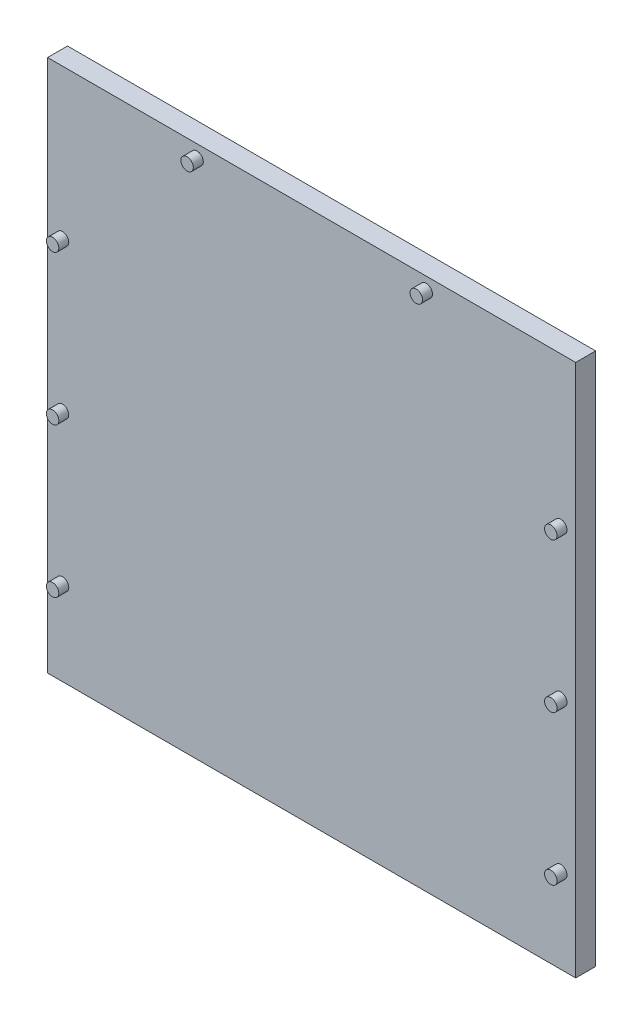
ISO-10303-21;
HEADER;
FILE_DESCRIPTION(('STEP AP214'),'2;1');
FILE_NAME('part.step','',(''),(''),'','','');
FILE_SCHEMA(('AUTOMOTIVE_DESIGN { 1 0 10303 214 1 1 1 1 }'));
ENDSEC;
DATA;
#1=APPLICATION_CONTEXT('core data for automotive mechanical design processes');
#2=APPLICATION_PROTOCOL_DEFINITION('international standard','automotive_design',2000,#1);
#3=PRODUCT_CONTEXT('',#1,'mechanical');
#4=PRODUCT('Part','Part','',(#3));
#5=PRODUCT_RELATED_PRODUCT_CATEGORY('part','',(#4));
#6=PRODUCT_DEFINITION_FORMATION('','',#4);
#7=PRODUCT_DEFINITION_CONTEXT('part definition',#1,'design');
#8=PRODUCT_DEFINITION('design','',#6,#7);
#9=PRODUCT_DEFINITION_SHAPE('','',#8);
#10=(LENGTH_UNIT() NAMED_UNIT(*) SI_UNIT(.MILLI.,.METRE.));
#11=(NAMED_UNIT(*) PLANE_ANGLE_UNIT() SI_UNIT($,.RADIAN.));
#12=(NAMED_UNIT(*) SI_UNIT($,.STERADIAN.) SOLID_ANGLE_UNIT());
#13=UNCERTAINTY_MEASURE_WITH_UNIT(LENGTH_MEASURE(1.E-05),#10,'distance_accuracy_value','');
#14=(GEOMETRIC_REPRESENTATION_CONTEXT(3) GLOBAL_UNCERTAINTY_ASSIGNED_CONTEXT((#13)) GLOBAL_UNIT_ASSIGNED_CONTEXT((#10,
#11,#12)) REPRESENTATION_CONTEXT('',''));
#15=CARTESIAN_POINT('',(0.,0.,0.));
#16=DIRECTION('',(0.,0.,1.));
#17=DIRECTION('',(1.,0.,0.));
#18=AXIS2_PLACEMENT_3D('',#15,#16,#17);
#19=CARTESIAN_POINT('',(-26.5,-26.75,2.));
#20=DIRECTION('',(1.,0.,0.));
#21=DIRECTION('',(0.,0.,-1.));
#22=AXIS2_PLACEMENT_3D('',#19,#20,#21);
#23=PLANE('',#22);
#24=DIRECTION('',(0.,-1.,0.));
#25=VECTOR('',#24,1.);
#26=CARTESIAN_POINT('',(-26.5,-26.75,0.));
#27=LINE('',#26,#25);
#28=CARTESIAN_POINT('',(-26.5,26.75,0.));
#29=VERTEX_POINT('',#28);
#30=CARTESIAN_POINT('',(-26.5,-26.75,0.));
#31=VERTEX_POINT('',#30);
#32=EDGE_CURVE('E96',#29,#31,#27,.T.);
#33=ORIENTED_EDGE('',*,*,#32,.T.);
#34=DIRECTION('',(0.,0.,-1.));
#35=VECTOR('',#34,1.);
#36=CARTESIAN_POINT('',(-26.5,-26.75,2.));
#37=LINE('',#36,#35);
#38=CARTESIAN_POINT('',(-26.5,-26.75,2.));
#39=VERTEX_POINT('',#38);
#40=EDGE_CURVE('E11',#39,#31,#37,.T.);
#41=ORIENTED_EDGE('',*,*,#40,.F.);
#42=DIRECTION('',(0.,-1.,0.));
#43=VECTOR('',#42,1.);
#44=CARTESIAN_POINT('',(-26.5,-26.75,2.));
#45=LINE('',#44,#43);
#46=CARTESIAN_POINT('',(-26.5,26.75,2.));
#47=VERTEX_POINT('',#46);
#48=EDGE_CURVE('E84',#47,#39,#45,.T.);
#49=ORIENTED_EDGE('',*,*,#48,.F.);
#50=DIRECTION('',(0.,0.,-1.));
#51=VECTOR('',#50,1.);
#52=CARTESIAN_POINT('',(-26.5,26.75,2.));
#53=LINE('',#52,#51);
#54=EDGE_CURVE('E92',#47,#29,#53,.T.);
#55=ORIENTED_EDGE('',*,*,#54,.T.);
#56=EDGE_LOOP('',(#33,#41,#49,#55));
#57=FACE_BOUND('',#56,.T.);
#58=ADVANCED_FACE('F33',(#57),#23,.F.);
#59=CARTESIAN_POINT('',(26.5,-26.75,2.));
#60=DIRECTION('',(0.,1.,0.));
#61=DIRECTION('',(-1.,0.,0.));
#62=AXIS2_PLACEMENT_3D('',#59,#60,#61);
#63=PLANE('',#62);
#64=DIRECTION('',(1.,0.,0.));
#65=VECTOR('',#64,1.);
#66=CARTESIAN_POINT('',(26.5,-26.75,0.));
#67=LINE('',#66,#65);
#68=CARTESIAN_POINT('',(26.5,-26.75,0.));
#69=VERTEX_POINT('',#68);
#70=EDGE_CURVE('E88',#31,#69,#67,.T.);
#71=ORIENTED_EDGE('',*,*,#70,.T.);
#72=DIRECTION('',(0.,0.,-1.));
#73=VECTOR('',#72,1.);
#74=CARTESIAN_POINT('',(26.5,-26.75,2.));
#75=LINE('',#74,#73);
#76=CARTESIAN_POINT('',(26.5,-26.75,2.));
#77=VERTEX_POINT('',#76);
#78=EDGE_CURVE('E41',#77,#69,#75,.T.);
#79=ORIENTED_EDGE('',*,*,#78,.F.);
#80=DIRECTION('',(1.,0.,0.));
#81=VECTOR('',#80,1.);
#82=CARTESIAN_POINT('',(26.5,-26.75,2.));
#83=LINE('',#82,#81);
#84=EDGE_CURVE('E79',#39,#77,#83,.T.);
#85=ORIENTED_EDGE('',*,*,#84,.F.);
#86=ORIENTED_EDGE('',*,*,#40,.T.);
#87=EDGE_LOOP('',(#71,#79,#85,#86));
#88=FACE_BOUND('',#87,.T.);
#89=ADVANCED_FACE('F87',(#88),#63,.F.);
#90=CARTESIAN_POINT('',(26.5,-26.75,2.));
#91=DIRECTION('',(-1.,0.,0.));
#92=DIRECTION('',(0.,0.,1.));
#93=AXIS2_PLACEMENT_3D('',#90,#91,#92);
#94=PLANE('',#93);
#95=DIRECTION('',(0.,1.,0.));
#96=VECTOR('',#95,1.);
#97=CARTESIAN_POINT('',(26.5,-26.75,0.));
#98=LINE('',#97,#96);
#99=CARTESIAN_POINT('',(26.5,26.75,0.));
#100=VERTEX_POINT('',#99);
#101=EDGE_CURVE('E66',#69,#100,#98,.T.);
#102=ORIENTED_EDGE('',*,*,#101,.T.);
#103=DIRECTION('',(0.,0.,-1.));
#104=VECTOR('',#103,1.);
#105=CARTESIAN_POINT('',(26.5,26.75,2.));
#106=LINE('',#105,#104);
#107=CARTESIAN_POINT('',(26.5,26.75,2.));
#108=VERTEX_POINT('',#107);
#109=EDGE_CURVE('E89',#108,#100,#106,.T.);
#110=ORIENTED_EDGE('',*,*,#109,.F.);
#111=DIRECTION('',(0.,1.,0.));
#112=VECTOR('',#111,1.);
#113=CARTESIAN_POINT('',(26.5,-26.75,2.));
#114=LINE('',#113,#112);
#115=EDGE_CURVE('E82',#77,#108,#114,.T.);
#116=ORIENTED_EDGE('',*,*,#115,.F.);
#117=ORIENTED_EDGE('',*,*,#78,.T.);
#118=EDGE_LOOP('',(#102,#110,#116,#117));
#119=FACE_BOUND('',#118,.T.);
#120=ADVANCED_FACE('F90',(#119),#94,.F.);
#121=CARTESIAN_POINT('',(26.5,26.75,2.));
#122=DIRECTION('',(0.,-1.,0.));
#123=DIRECTION('',(1.,0.,0.));
#124=AXIS2_PLACEMENT_3D('',#121,#122,#123);
#125=PLANE('',#124);
#126=DIRECTION('',(-1.,0.,0.));
#127=VECTOR('',#126,1.);
#128=CARTESIAN_POINT('',(26.5,26.75,0.));
#129=LINE('',#128,#127);
#130=EDGE_CURVE('E72',#100,#29,#129,.T.);
#131=ORIENTED_EDGE('',*,*,#130,.T.);
#132=ORIENTED_EDGE('',*,*,#54,.F.);
#133=DIRECTION('',(-1.,0.,0.));
#134=VECTOR('',#133,1.);
#135=CARTESIAN_POINT('',(26.5,26.75,2.));
#136=LINE('',#135,#134);
#137=EDGE_CURVE('E49',#108,#47,#136,.T.);
#138=ORIENTED_EDGE('',*,*,#137,.F.);
#139=ORIENTED_EDGE('',*,*,#109,.T.);
#140=EDGE_LOOP('',(#131,#132,#138,#139));
#141=FACE_BOUND('',#140,.T.);
#142=ADVANCED_FACE('F104',(#141),#125,.F.);
#143=CARTESIAN_POINT('',(0.,0.,2.));
#144=DIRECTION('',(0.,0.,1.));
#145=DIRECTION('',(1.,0.,0.));
#146=AXIS2_PLACEMENT_3D('',#143,#144,#145);
#147=PLANE('',#146);
#148=CARTESIAN_POINT('',(25.,-18.25,2.));
#149=DIRECTION('',(0.,0.,1.));
#150=DIRECTION('',(1.,0.,0.));
#151=AXIS2_PLACEMENT_3D('',#148,#149,#150);
#152=CIRCLE('',#151,0.625000000000002);
#153=CARTESIAN_POINT('',(25.625,-18.25,2.));
#154=VERTEX_POINT('',#153);
#155=EDGE_CURVE('E152',#154,#154,#152,.T.);
#156=ORIENTED_EDGE('',*,*,#155,.F.);
#157=EDGE_LOOP('',(#156));
#158=FACE_BOUND('',#157,.T.);
#159=CARTESIAN_POINT('',(25.,-3.25,2.));
#160=DIRECTION('',(0.,0.,1.));
#161=DIRECTION('',(1.,0.,0.));
#162=AXIS2_PLACEMENT_3D('',#159,#160,#161);
#163=CIRCLE('',#162,0.624999999999999);
#164=CARTESIAN_POINT('',(25.625,-3.25,2.));
#165=VERTEX_POINT('',#164);
#166=EDGE_CURVE('E146',#165,#165,#163,.T.);
#167=ORIENTED_EDGE('',*,*,#166,.F.);
#168=EDGE_LOOP('',(#167));
#169=FACE_BOUND('',#168,.T.);
#170=CARTESIAN_POINT('',(25.,11.75,2.));
#171=DIRECTION('',(0.,0.,1.));
#172=DIRECTION('',(1.,0.,0.));
#173=AXIS2_PLACEMENT_3D('',#170,#171,#172);
#174=CIRCLE('',#173,0.625000000000002);
#175=CARTESIAN_POINT('',(25.625,11.75,2.));
#176=VERTEX_POINT('',#175);
#177=EDGE_CURVE('E140',#176,#176,#174,.T.);
#178=ORIENTED_EDGE('',*,*,#177,.F.);
#179=EDGE_LOOP('',(#178));
#180=FACE_BOUND('',#179,.T.);
#181=CARTESIAN_POINT('',(-25.,-18.25,2.));
#182=DIRECTION('',(0.,0.,1.));
#183=DIRECTION('',(1.,0.,0.));
#184=AXIS2_PLACEMENT_3D('',#181,#182,#183);
#185=CIRCLE('',#184,0.624999999999999);
#186=CARTESIAN_POINT('',(-24.375,-18.25,2.));
#187=VERTEX_POINT('',#186);
#188=EDGE_CURVE('E134',#187,#187,#185,.T.);
#189=ORIENTED_EDGE('',*,*,#188,.F.);
#190=EDGE_LOOP('',(#189));
#191=FACE_BOUND('',#190,.T.);
#192=CARTESIAN_POINT('',(-25.,-3.25,2.));
#193=DIRECTION('',(0.,0.,1.));
#194=DIRECTION('',(1.,0.,0.));
#195=AXIS2_PLACEMENT_3D('',#192,#193,#194);
#196=CIRCLE('',#195,0.625000000000002);
#197=CARTESIAN_POINT('',(-24.375,-3.25,2.));
#198=VERTEX_POINT('',#197);
#199=EDGE_CURVE('E128',#198,#198,#196,.T.);
#200=ORIENTED_EDGE('',*,*,#199,.F.);
#201=EDGE_LOOP('',(#200));
#202=FACE_BOUND('',#201,.T.);
#203=CARTESIAN_POINT('',(-25.,11.75,2.));
#204=DIRECTION('',(0.,0.,1.));
#205=DIRECTION('',(1.,0.,0.));
#206=AXIS2_PLACEMENT_3D('',#203,#204,#205);
#207=CIRCLE('',#206,0.625000000000002);
#208=CARTESIAN_POINT('',(-24.375,11.75,2.));
#209=VERTEX_POINT('',#208);
#210=EDGE_CURVE('E122',#209,#209,#207,.T.);
#211=ORIENTED_EDGE('',*,*,#210,.F.);
#212=EDGE_LOOP('',(#211));
#213=FACE_BOUND('',#212,.T.);
#214=CARTESIAN_POINT('',(11.5,25.5,2.));
#215=DIRECTION('',(0.,0.,1.));
#216=DIRECTION('',(1.,0.,0.));
#217=AXIS2_PLACEMENT_3D('',#214,#215,#216);
#218=CIRCLE('',#217,0.625000000000001);
#219=CARTESIAN_POINT('',(12.125,25.5,2.));
#220=VERTEX_POINT('',#219);
#221=EDGE_CURVE('E116',#220,#220,#218,.T.);
#222=ORIENTED_EDGE('',*,*,#221,.F.);
#223=EDGE_LOOP('',(#222));
#224=FACE_BOUND('',#223,.T.);
#225=CARTESIAN_POINT('',(-11.5,25.5,2.));
#226=DIRECTION('',(0.,0.,1.));
#227=DIRECTION('',(1.,0.,0.));
#228=AXIS2_PLACEMENT_3D('',#225,#226,#227);
#229=CIRCLE('',#228,0.625000000000001);
#230=CARTESIAN_POINT('',(-10.875,25.5,2.));
#231=VERTEX_POINT('',#230);
#232=EDGE_CURVE('E110',#231,#231,#229,.T.);
#233=ORIENTED_EDGE('',*,*,#232,.F.);
#234=EDGE_LOOP('',(#233));
#235=FACE_BOUND('',#234,.T.);
#236=ORIENTED_EDGE('',*,*,#48,.T.);
#237=ORIENTED_EDGE('',*,*,#84,.T.);
#238=ORIENTED_EDGE('',*,*,#115,.T.);
#239=ORIENTED_EDGE('',*,*,#137,.T.);
#240=EDGE_LOOP('',(#236,#237,#238,#239));
#241=FACE_BOUND('',#240,.T.);
#242=ADVANCED_FACE('F80',(#158,#169,#180,#191,#202,#213,#224,#235,#241),#147,.T.);
#243=CARTESIAN_POINT('',(0.,0.,0.));
#244=DIRECTION('',(0.,0.,1.));
#245=DIRECTION('',(1.,0.,0.));
#246=AXIS2_PLACEMENT_3D('',#243,#244,#245);
#247=PLANE('',#246);
#248=ORIENTED_EDGE('',*,*,#32,.F.);
#249=ORIENTED_EDGE('',*,*,#130,.F.);
#250=ORIENTED_EDGE('',*,*,#101,.F.);
#251=ORIENTED_EDGE('',*,*,#70,.F.);
#252=EDGE_LOOP('',(#248,#249,#250,#251));
#253=FACE_BOUND('',#252,.T.);
#254=ADVANCED_FACE('F107',(#253),#247,.F.);
#255=CARTESIAN_POINT('',(-11.5,25.5,3.));
#256=DIRECTION('',(0.,0.,-1.));
#257=DIRECTION('',(-1.,0.,0.));
#258=AXIS2_PLACEMENT_3D('',#255,#256,#257);
#259=CYLINDRICAL_SURFACE('',#258,0.625000000000001);
#260=CARTESIAN_POINT('',(-11.5,25.5,3.));
#261=DIRECTION('',(0.,0.,1.));
#262=DIRECTION('',(1.,0.,0.));
#263=AXIS2_PLACEMENT_3D('',#260,#261,#262);
#264=CIRCLE('',#263,0.625000000000001);
#265=CARTESIAN_POINT('',(-10.875,25.5,3.));
#266=VERTEX_POINT('',#265);
#267=EDGE_CURVE('E99',#266,#266,#264,.T.);
#268=ORIENTED_EDGE('',*,*,#267,.F.);
#269=EDGE_LOOP('',(#268));
#270=FACE_BOUND('',#269,.T.);
#271=ORIENTED_EDGE('',*,*,#232,.T.);
#272=EDGE_LOOP('',(#271));
#273=FACE_BOUND('',#272,.T.);
#274=ADVANCED_FACE('F184',(#270,#273),#259,.T.);
#275=CARTESIAN_POINT('',(-11.5,25.5,3.));
#276=DIRECTION('',(0.,0.,1.));
#277=DIRECTION('',(1.,0.,0.));
#278=AXIS2_PLACEMENT_3D('',#275,#276,#277);
#279=PLANE('',#278);
#280=ORIENTED_EDGE('',*,*,#267,.T.);
#281=EDGE_LOOP('',(#280));
#282=FACE_BOUND('',#281,.T.);
#283=ADVANCED_FACE('F186',(#282),#279,.T.);
#284=CARTESIAN_POINT('',(11.5,25.5,3.));
#285=DIRECTION('',(0.,0.,-1.));
#286=DIRECTION('',(-1.,0.,0.));
#287=AXIS2_PLACEMENT_3D('',#284,#285,#286);
#288=CYLINDRICAL_SURFACE('',#287,0.625000000000001);
#289=CARTESIAN_POINT('',(11.5,25.5,3.));
#290=DIRECTION('',(0.,0.,1.));
#291=DIRECTION('',(1.,0.,0.));
#292=AXIS2_PLACEMENT_3D('',#289,#290,#291);
#293=CIRCLE('',#292,0.625000000000001);
#294=CARTESIAN_POINT('',(12.125,25.5,3.));
#295=VERTEX_POINT('',#294);
#296=EDGE_CURVE('E113',#295,#295,#293,.T.);
#297=ORIENTED_EDGE('',*,*,#296,.F.);
#298=EDGE_LOOP('',(#297));
#299=FACE_BOUND('',#298,.T.);
#300=ORIENTED_EDGE('',*,*,#221,.T.);
#301=EDGE_LOOP('',(#300));
#302=FACE_BOUND('',#301,.T.);
#303=ADVANCED_FACE('F193',(#299,#302),#288,.T.);
#304=CARTESIAN_POINT('',(11.5,25.5,3.));
#305=DIRECTION('',(0.,0.,1.));
#306=DIRECTION('',(1.,0.,0.));
#307=AXIS2_PLACEMENT_3D('',#304,#305,#306);
#308=PLANE('',#307);
#309=ORIENTED_EDGE('',*,*,#296,.T.);
#310=EDGE_LOOP('',(#309));
#311=FACE_BOUND('',#310,.T.);
#312=ADVANCED_FACE('F241',(#311),#308,.T.);
#313=CARTESIAN_POINT('',(-25.,11.75,3.));
#314=DIRECTION('',(0.,0.,-1.));
#315=DIRECTION('',(-1.,0.,0.));
#316=AXIS2_PLACEMENT_3D('',#313,#314,#315);
#317=CYLINDRICAL_SURFACE('',#316,0.625000000000002);
#318=CARTESIAN_POINT('',(-25.,11.75,3.));
#319=DIRECTION('',(0.,0.,1.));
#320=DIRECTION('',(1.,0.,0.));
#321=AXIS2_PLACEMENT_3D('',#318,#319,#320);
#322=CIRCLE('',#321,0.625000000000002);
#323=CARTESIAN_POINT('',(-24.375,11.75,3.));
#324=VERTEX_POINT('',#323);
#325=EDGE_CURVE('E119',#324,#324,#322,.T.);
#326=ORIENTED_EDGE('',*,*,#325,.F.);
#327=EDGE_LOOP('',(#326));
#328=FACE_BOUND('',#327,.T.);
#329=ORIENTED_EDGE('',*,*,#210,.T.);
#330=EDGE_LOOP('',(#329));
#331=FACE_BOUND('',#330,.T.);
#332=ADVANCED_FACE('F250',(#328,#331),#317,.T.);
#333=CARTESIAN_POINT('',(-25.,11.75,3.));
#334=DIRECTION('',(0.,0.,1.));
#335=DIRECTION('',(1.,0.,0.));
#336=AXIS2_PLACEMENT_3D('',#333,#334,#335);
#337=PLANE('',#336);
#338=ORIENTED_EDGE('',*,*,#325,.T.);
#339=EDGE_LOOP('',(#338));
#340=FACE_BOUND('',#339,.T.);
#341=ADVANCED_FACE('F259',(#340),#337,.T.);
#342=CARTESIAN_POINT('',(-25.,-3.25,3.));
#343=DIRECTION('',(0.,0.,-1.));
#344=DIRECTION('',(-1.,0.,0.));
#345=AXIS2_PLACEMENT_3D('',#342,#343,#344);
#346=CYLINDRICAL_SURFACE('',#345,0.625000000000002);
#347=CARTESIAN_POINT('',(-25.,-3.25,3.));
#348=DIRECTION('',(0.,0.,1.));
#349=DIRECTION('',(1.,0.,0.));
#350=AXIS2_PLACEMENT_3D('',#347,#348,#349);
#351=CIRCLE('',#350,0.625000000000002);
#352=CARTESIAN_POINT('',(-24.375,-3.25,3.));
#353=VERTEX_POINT('',#352);
#354=EDGE_CURVE('E125',#353,#353,#351,.T.);
#355=ORIENTED_EDGE('',*,*,#354,.F.);
#356=EDGE_LOOP('',(#355));
#357=FACE_BOUND('',#356,.T.);
#358=ORIENTED_EDGE('',*,*,#199,.T.);
#359=EDGE_LOOP('',(#358));
#360=FACE_BOUND('',#359,.T.);
#361=ADVANCED_FACE('F268',(#357,#360),#346,.T.);
#362=CARTESIAN_POINT('',(-25.,-3.25,3.));
#363=DIRECTION('',(0.,0.,1.));
#364=DIRECTION('',(1.,0.,0.));
#365=AXIS2_PLACEMENT_3D('',#362,#363,#364);
#366=PLANE('',#365);
#367=ORIENTED_EDGE('',*,*,#354,.T.);
#368=EDGE_LOOP('',(#367));
#369=FACE_BOUND('',#368,.T.);
#370=ADVANCED_FACE('F277',(#369),#366,.T.);
#371=CARTESIAN_POINT('',(-25.,-18.25,3.));
#372=DIRECTION('',(0.,0.,-1.));
#373=DIRECTION('',(-1.,0.,0.));
#374=AXIS2_PLACEMENT_3D('',#371,#372,#373);
#375=CYLINDRICAL_SURFACE('',#374,0.624999999999999);
#376=CARTESIAN_POINT('',(-25.,-18.25,3.));
#377=DIRECTION('',(0.,0.,1.));
#378=DIRECTION('',(1.,0.,0.));
#379=AXIS2_PLACEMENT_3D('',#376,#377,#378);
#380=CIRCLE('',#379,0.624999999999999);
#381=CARTESIAN_POINT('',(-24.375,-18.25,3.));
#382=VERTEX_POINT('',#381);
#383=EDGE_CURVE('E131',#382,#382,#380,.T.);
#384=ORIENTED_EDGE('',*,*,#383,.F.);
#385=EDGE_LOOP('',(#384));
#386=FACE_BOUND('',#385,.T.);
#387=ORIENTED_EDGE('',*,*,#188,.T.);
#388=EDGE_LOOP('',(#387));
#389=FACE_BOUND('',#388,.T.);
#390=ADVANCED_FACE('F286',(#386,#389),#375,.T.);
#391=CARTESIAN_POINT('',(-25.,-18.25,3.));
#392=DIRECTION('',(0.,0.,1.));
#393=DIRECTION('',(1.,0.,0.));
#394=AXIS2_PLACEMENT_3D('',#391,#392,#393);
#395=PLANE('',#394);
#396=ORIENTED_EDGE('',*,*,#383,.T.);
#397=EDGE_LOOP('',(#396));
#398=FACE_BOUND('',#397,.T.);
#399=ADVANCED_FACE('F295',(#398),#395,.T.);
#400=CARTESIAN_POINT('',(25.,11.75,3.));
#401=DIRECTION('',(0.,0.,-1.));
#402=DIRECTION('',(-1.,0.,0.));
#403=AXIS2_PLACEMENT_3D('',#400,#401,#402);
#404=CYLINDRICAL_SURFACE('',#403,0.625000000000002);
#405=CARTESIAN_POINT('',(25.,11.75,3.));
#406=DIRECTION('',(0.,0.,1.));
#407=DIRECTION('',(1.,0.,0.));
#408=AXIS2_PLACEMENT_3D('',#405,#406,#407);
#409=CIRCLE('',#408,0.625000000000002);
#410=CARTESIAN_POINT('',(25.625,11.75,3.));
#411=VERTEX_POINT('',#410);
#412=EDGE_CURVE('E137',#411,#411,#409,.T.);
#413=ORIENTED_EDGE('',*,*,#412,.F.);
#414=EDGE_LOOP('',(#413));
#415=FACE_BOUND('',#414,.T.);
#416=ORIENTED_EDGE('',*,*,#177,.T.);
#417=EDGE_LOOP('',(#416));
#418=FACE_BOUND('',#417,.T.);
#419=ADVANCED_FACE('F304',(#415,#418),#404,.T.);
#420=CARTESIAN_POINT('',(25.,11.75,3.));
#421=DIRECTION('',(0.,0.,1.));
#422=DIRECTION('',(1.,0.,0.));
#423=AXIS2_PLACEMENT_3D('',#420,#421,#422);
#424=PLANE('',#423);
#425=ORIENTED_EDGE('',*,*,#412,.T.);
#426=EDGE_LOOP('',(#425));
#427=FACE_BOUND('',#426,.T.);
#428=ADVANCED_FACE('F313',(#427),#424,.T.);
#429=CARTESIAN_POINT('',(25.,-3.25,3.));
#430=DIRECTION('',(0.,0.,-1.));
#431=DIRECTION('',(-1.,0.,0.));
#432=AXIS2_PLACEMENT_3D('',#429,#430,#431);
#433=CYLINDRICAL_SURFACE('',#432,0.624999999999999);
#434=CARTESIAN_POINT('',(25.,-3.25,3.));
#435=DIRECTION('',(0.,0.,1.));
#436=DIRECTION('',(1.,0.,0.));
#437=AXIS2_PLACEMENT_3D('',#434,#435,#436);
#438=CIRCLE('',#437,0.624999999999999);
#439=CARTESIAN_POINT('',(25.625,-3.25,3.));
#440=VERTEX_POINT('',#439);
#441=EDGE_CURVE('E143',#440,#440,#438,.T.);
#442=ORIENTED_EDGE('',*,*,#441,.F.);
#443=EDGE_LOOP('',(#442));
#444=FACE_BOUND('',#443,.T.);
#445=ORIENTED_EDGE('',*,*,#166,.T.);
#446=EDGE_LOOP('',(#445));
#447=FACE_BOUND('',#446,.T.);
#448=ADVANCED_FACE('F322',(#444,#447),#433,.T.);
#449=CARTESIAN_POINT('',(25.,-3.25,3.));
#450=DIRECTION('',(0.,0.,1.));
#451=DIRECTION('',(1.,0.,0.));
#452=AXIS2_PLACEMENT_3D('',#449,#450,#451);
#453=PLANE('',#452);
#454=ORIENTED_EDGE('',*,*,#441,.T.);
#455=EDGE_LOOP('',(#454));
#456=FACE_BOUND('',#455,.T.);
#457=ADVANCED_FACE('F163',(#456),#453,.T.);
#458=CARTESIAN_POINT('',(25.,-18.25,3.));
#459=DIRECTION('',(0.,0.,-1.));
#460=DIRECTION('',(-1.,0.,0.));
#461=AXIS2_PLACEMENT_3D('',#458,#459,#460);
#462=CYLINDRICAL_SURFACE('',#461,0.625000000000002);
#463=CARTESIAN_POINT('',(25.,-18.25,3.));
#464=DIRECTION('',(0.,0.,1.));
#465=DIRECTION('',(1.,0.,0.));
#466=AXIS2_PLACEMENT_3D('',#463,#464,#465);
#467=CIRCLE('',#466,0.625000000000002);
#468=CARTESIAN_POINT('',(25.625,-18.25,3.));
#469=VERTEX_POINT('',#468);
#470=EDGE_CURVE('E149',#469,#469,#467,.T.);
#471=ORIENTED_EDGE('',*,*,#470,.F.);
#472=EDGE_LOOP('',(#471));
#473=FACE_BOUND('',#472,.T.);
#474=ORIENTED_EDGE('',*,*,#155,.T.);
#475=EDGE_LOOP('',(#474));
#476=FACE_BOUND('',#475,.T.);
#477=ADVANCED_FACE('F160',(#473,#476),#462,.T.);
#478=CARTESIAN_POINT('',(25.,-18.25,3.));
#479=DIRECTION('',(0.,0.,1.));
#480=DIRECTION('',(1.,0.,0.));
#481=AXIS2_PLACEMENT_3D('',#478,#479,#480);
#482=PLANE('',#481);
#483=ORIENTED_EDGE('',*,*,#470,.T.);
#484=EDGE_LOOP('',(#483));
#485=FACE_BOUND('',#484,.T.);
#486=ADVANCED_FACE('F158',(#485),#482,.T.);
#487=CLOSED_SHELL('',(#58,#89,#120,#142,#242,#254,#274,#283,#303,#312,#332,#341,#361,#370,#390,
#399,#419,#428,#448,#457,#477,#486));
#488=MANIFOLD_SOLID_BREP('B2',#487);
#489=ADVANCED_BREP_SHAPE_REPRESENTATION('',(#18,#488),#14);
#490=SHAPE_DEFINITION_REPRESENTATION(#9,#489);
ENDSEC;
END-ISO-10303-21;
